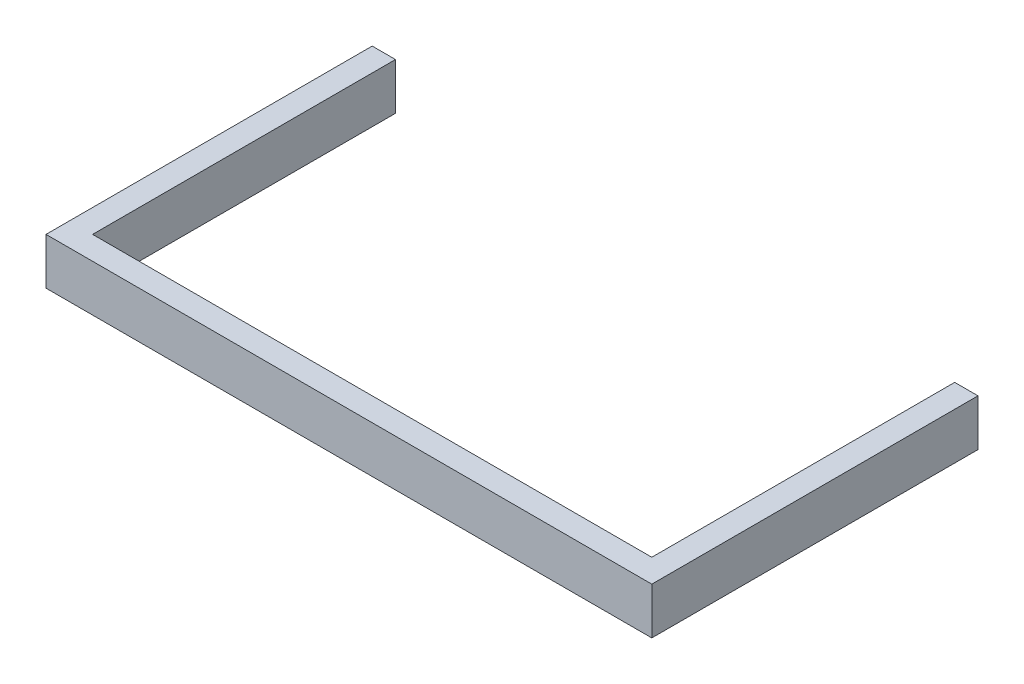
ISO-10303-21;
HEADER;
FILE_DESCRIPTION(('STEP AP214'),'2;1');
FILE_NAME('part.step','',(''),(''),'','','');
FILE_SCHEMA(('AUTOMOTIVE_DESIGN { 1 0 10303 214 1 1 1 1 }'));
ENDSEC;
DATA;
#1=APPLICATION_CONTEXT('core data for automotive mechanical design processes');
#2=APPLICATION_PROTOCOL_DEFINITION('international standard','automotive_design',2000,#1);
#3=PRODUCT_CONTEXT('',#1,'mechanical');
#4=PRODUCT('Part','Part','',(#3));
#5=PRODUCT_RELATED_PRODUCT_CATEGORY('part','',(#4));
#6=PRODUCT_DEFINITION_FORMATION('','',#4);
#7=PRODUCT_DEFINITION_CONTEXT('part definition',#1,'design');
#8=PRODUCT_DEFINITION('design','',#6,#7);
#9=PRODUCT_DEFINITION_SHAPE('','',#8);
#10=(LENGTH_UNIT() NAMED_UNIT(*) SI_UNIT(.MILLI.,.METRE.));
#11=(NAMED_UNIT(*) PLANE_ANGLE_UNIT() SI_UNIT($,.RADIAN.));
#12=(NAMED_UNIT(*) SI_UNIT($,.STERADIAN.) SOLID_ANGLE_UNIT());
#13=UNCERTAINTY_MEASURE_WITH_UNIT(LENGTH_MEASURE(1.E-05),#10,'distance_accuracy_value','');
#14=(GEOMETRIC_REPRESENTATION_CONTEXT(3) GLOBAL_UNCERTAINTY_ASSIGNED_CONTEXT((#13)) GLOBAL_UNIT_ASSIGNED_CONTEXT((#10,
#11,#12)) REPRESENTATION_CONTEXT('',''));
#15=CARTESIAN_POINT('',(0.,0.,0.));
#16=DIRECTION('',(0.,0.,1.));
#17=DIRECTION('',(1.,0.,0.));
#18=AXIS2_PLACEMENT_3D('',#15,#16,#17);
#19=CARTESIAN_POINT('',(0.,50.8000000000004,-25.4000000000003));
#20=DIRECTION('',(0.,0.,-1.));
#21=DIRECTION('',(-1.,0.,0.));
#22=AXIS2_PLACEMENT_3D('',#19,#20,#21);
#23=PLANE('',#22);
#24=DIRECTION('',(1.,0.,0.));
#25=VECTOR('',#24,1.);
#26=CARTESIAN_POINT('',(0.,-2.22044604925031E-13,-25.4000000000003));
#27=LINE('',#26,#25);
#28=CARTESIAN_POINT('',(25.4000000000001,0.,-25.3999999999999));
#29=VERTEX_POINT('',#28);
#30=CARTESIAN_POINT('',(635.,-1.33226762955019E-12,-25.3999999999994));
#31=VERTEX_POINT('',#30);
#32=EDGE_CURVE('E131',#29,#31,#27,.T.);
#33=ORIENTED_EDGE('',*,*,#32,.F.);
#34=DIRECTION('',(0.,-1.,0.));
#35=VECTOR('',#34,1.);
#36=CARTESIAN_POINT('',(25.4000000000001,50.8,-25.3999999999999));
#37=LINE('',#36,#35);
#38=CARTESIAN_POINT('',(25.4000000000001,50.8,-25.3999999999999));
#39=VERTEX_POINT('',#38);
#40=EDGE_CURVE('E11',#39,#29,#37,.T.);
#41=ORIENTED_EDGE('',*,*,#40,.F.);
#42=DIRECTION('',(1.,0.,0.));
#43=VECTOR('',#42,1.);
#44=CARTESIAN_POINT('',(0.,50.8000000000004,-25.4000000000003));
#45=LINE('',#44,#43);
#46=CARTESIAN_POINT('',(635.,50.8000000000017,-25.3999999999994));
#47=VERTEX_POINT('',#46);
#48=EDGE_CURVE('E150',#39,#47,#45,.T.);
#49=ORIENTED_EDGE('',*,*,#48,.T.);
#50=DIRECTION('',(0.,-1.,0.));
#51=VECTOR('',#50,1.);
#52=CARTESIAN_POINT('',(635.,50.8000000000017,-25.3999999999994));
#53=LINE('',#52,#51);
#54=EDGE_CURVE('E52',#47,#31,#53,.T.);
#55=ORIENTED_EDGE('',*,*,#54,.T.);
#56=EDGE_LOOP('',(#33,#41,#49,#55));
#57=FACE_BOUND('',#56,.T.);
#58=ADVANCED_FACE('F36',(#57),#23,.T.);
#59=CARTESIAN_POINT('',(25.4000000000001,50.7999999999995,1.11022302462516E-12));
#60=DIRECTION('',(-1.,0.,0.));
#61=DIRECTION('',(0.,0.,1.));
#62=AXIS2_PLACEMENT_3D('',#59,#60,#61);
#63=PLANE('',#62);
#64=DIRECTION('',(0.,0.,-1.));
#65=VECTOR('',#64,1.);
#66=CARTESIAN_POINT('',(25.4000000000001,0.,0.));
#67=LINE('',#66,#65);
#68=CARTESIAN_POINT('',(25.3999999999988,0.,-355.6));
#69=VERTEX_POINT('',#68);
#70=EDGE_CURVE('E133',#29,#69,#67,.T.);
#71=ORIENTED_EDGE('',*,*,#70,.T.);
#72=DIRECTION('',(0.,-1.,0.));
#73=VECTOR('',#72,1.);
#74=CARTESIAN_POINT('',(25.4000000000001,50.8,-355.6));
#75=LINE('',#74,#73);
#76=CARTESIAN_POINT('',(25.4000000000001,50.8,-355.6));
#77=VERTEX_POINT('',#76);
#78=EDGE_CURVE('E44',#77,#69,#75,.T.);
#79=ORIENTED_EDGE('',*,*,#78,.F.);
#80=DIRECTION('',(0.,0.,-1.));
#81=VECTOR('',#80,1.);
#82=CARTESIAN_POINT('',(25.4000000000001,50.7999999999995,1.11022302462516E-12));
#83=LINE('',#82,#81);
#84=EDGE_CURVE('E175',#39,#77,#83,.T.);
#85=ORIENTED_EDGE('',*,*,#84,.F.);
#86=ORIENTED_EDGE('',*,*,#40,.T.);
#87=EDGE_LOOP('',(#71,#79,#85,#86));
#88=FACE_BOUND('',#87,.T.);
#89=ADVANCED_FACE('F166',(#88),#63,.F.);
#90=CARTESIAN_POINT('',(-6.66133814775094E-13,50.8,-355.6));
#91=DIRECTION('',(0.,0.,-1.));
#92=DIRECTION('',(-1.,0.,0.));
#93=AXIS2_PLACEMENT_3D('',#90,#91,#92);
#94=PLANE('',#93);
#95=DIRECTION('',(1.,0.,0.));
#96=VECTOR('',#95,1.);
#97=CARTESIAN_POINT('',(-1.99840144432528E-12,0.,-355.6));
#98=LINE('',#97,#96);
#99=CARTESIAN_POINT('',(-1.33226762955019E-12,0.,-355.6));
#100=VERTEX_POINT('',#99);
#101=EDGE_CURVE('E136',#100,#69,#98,.T.);
#102=ORIENTED_EDGE('',*,*,#101,.F.);
#103=DIRECTION('',(0.,-1.,0.));
#104=VECTOR('',#103,1.);
#105=CARTESIAN_POINT('',(0.,50.8,-355.6));
#106=LINE('',#105,#104);
#107=CARTESIAN_POINT('',(0.,50.8,-355.6));
#108=VERTEX_POINT('',#107);
#109=EDGE_CURVE('E156',#108,#100,#106,.T.);
#110=ORIENTED_EDGE('',*,*,#109,.F.);
#111=DIRECTION('',(1.,0.,0.));
#112=VECTOR('',#111,1.);
#113=CARTESIAN_POINT('',(-6.66133814775094E-13,50.8,-355.6));
#114=LINE('',#113,#112);
#115=EDGE_CURVE('E163',#108,#77,#114,.T.);
#116=ORIENTED_EDGE('',*,*,#115,.T.);
#117=ORIENTED_EDGE('',*,*,#78,.T.);
#118=EDGE_LOOP('',(#102,#110,#116,#117));
#119=FACE_BOUND('',#118,.T.);
#120=ADVANCED_FACE('F161',(#119),#94,.T.);
#121=CARTESIAN_POINT('',(0.,50.7999999999991,2.22044604925031E-13));
#122=DIRECTION('',(-1.,0.,0.));
#123=DIRECTION('',(0.,0.,1.));
#124=AXIS2_PLACEMENT_3D('',#121,#122,#123);
#125=PLANE('',#124);
#126=DIRECTION('',(0.,0.,-1.));
#127=VECTOR('',#126,1.);
#128=CARTESIAN_POINT('',(0.,0.,0.));
#129=LINE('',#128,#127);
#130=CARTESIAN_POINT('',(0.,0.,0.));
#131=VERTEX_POINT('',#130);
#132=EDGE_CURVE('E139',#131,#100,#129,.T.);
#133=ORIENTED_EDGE('',*,*,#132,.F.);
#134=DIRECTION('',(0.,-1.,0.));
#135=VECTOR('',#134,1.);
#136=CARTESIAN_POINT('',(0.,50.7999999999991,2.22044604925031E-13));
#137=LINE('',#136,#135);
#138=CARTESIAN_POINT('',(0.,50.7999999999991,2.22044604925031E-13));
#139=VERTEX_POINT('',#138);
#140=EDGE_CURVE('E154',#139,#131,#137,.T.);
#141=ORIENTED_EDGE('',*,*,#140,.F.);
#142=DIRECTION('',(0.,0.,-1.));
#143=VECTOR('',#142,1.);
#144=CARTESIAN_POINT('',(0.,50.7999999999991,2.22044604925031E-13));
#145=LINE('',#144,#143);
#146=EDGE_CURVE('E174',#139,#108,#145,.T.);
#147=ORIENTED_EDGE('',*,*,#146,.T.);
#148=ORIENTED_EDGE('',*,*,#109,.T.);
#149=EDGE_LOOP('',(#133,#141,#147,#148));
#150=FACE_BOUND('',#149,.T.);
#151=ADVANCED_FACE('F172',(#150),#125,.T.);
#152=CARTESIAN_POINT('',(0.,50.7999999999991,2.22044604925031E-13));
#153=DIRECTION('',(0.,0.,-1.));
#154=DIRECTION('',(-1.,0.,0.));
#155=AXIS2_PLACEMENT_3D('',#152,#153,#154);
#156=PLANE('',#155);
#157=DIRECTION('',(1.,0.,0.));
#158=VECTOR('',#157,1.);
#159=CARTESIAN_POINT('',(0.,0.,0.));
#160=LINE('',#159,#158);
#161=CARTESIAN_POINT('',(660.4,0.,0.));
#162=VERTEX_POINT('',#161);
#163=EDGE_CURVE('E142',#131,#162,#160,.T.);
#164=ORIENTED_EDGE('',*,*,#163,.T.);
#165=DIRECTION('',(0.,-1.,0.));
#166=VECTOR('',#165,1.);
#167=CARTESIAN_POINT('',(660.4,50.8,1.11022302462516E-12));
#168=LINE('',#167,#166);
#169=CARTESIAN_POINT('',(660.4,50.8,1.11022302462516E-12));
#170=VERTEX_POINT('',#169);
#171=EDGE_CURVE('E123',#170,#162,#168,.T.);
#172=ORIENTED_EDGE('',*,*,#171,.F.);
#173=DIRECTION('',(1.,0.,0.));
#174=VECTOR('',#173,1.);
#175=CARTESIAN_POINT('',(0.,50.7999999999991,2.22044604925031E-13));
#176=LINE('',#175,#174);
#177=EDGE_CURVE('E111',#139,#170,#176,.T.);
#178=ORIENTED_EDGE('',*,*,#177,.F.);
#179=ORIENTED_EDGE('',*,*,#140,.T.);
#180=EDGE_LOOP('',(#164,#172,#178,#179));
#181=FACE_BOUND('',#180,.T.);
#182=ADVANCED_FACE('F201',(#181),#156,.F.);
#183=CARTESIAN_POINT('',(660.4,50.8,1.11022302462516E-12));
#184=DIRECTION('',(-1.,0.,0.));
#185=DIRECTION('',(0.,0.,1.));
#186=AXIS2_PLACEMENT_3D('',#183,#184,#185);
#187=PLANE('',#186);
#188=DIRECTION('',(0.,0.,-1.));
#189=VECTOR('',#188,1.);
#190=CARTESIAN_POINT('',(660.4,0.,0.));
#191=LINE('',#190,#189);
#192=CARTESIAN_POINT('',(660.399999999999,-8.88178419700125E-13,-355.6));
#193=VERTEX_POINT('',#192);
#194=EDGE_CURVE('E120',#162,#193,#191,.T.);
#195=ORIENTED_EDGE('',*,*,#194,.T.);
#196=DIRECTION('',(0.,-1.,0.));
#197=VECTOR('',#196,1.);
#198=CARTESIAN_POINT('',(660.4,50.8000000000004,-355.6));
#199=LINE('',#198,#197);
#200=CARTESIAN_POINT('',(660.4,50.8000000000004,-355.6));
#201=VERTEX_POINT('',#200);
#202=EDGE_CURVE('E117',#201,#193,#199,.T.);
#203=ORIENTED_EDGE('',*,*,#202,.F.);
#204=DIRECTION('',(0.,0.,-1.));
#205=VECTOR('',#204,1.);
#206=CARTESIAN_POINT('',(660.4,50.8,1.11022302462516E-12));
#207=LINE('',#206,#205);
#208=EDGE_CURVE('E102',#170,#201,#207,.T.);
#209=ORIENTED_EDGE('',*,*,#208,.F.);
#210=ORIENTED_EDGE('',*,*,#171,.T.);
#211=EDGE_LOOP('',(#195,#203,#209,#210));
#212=FACE_BOUND('',#211,.T.);
#213=ADVANCED_FACE('F118',(#212),#187,.F.);
#214=CARTESIAN_POINT('',(0.,50.8,-355.6));
#215=DIRECTION('',(0.,0.,1.));
#216=DIRECTION('',(1.,0.,0.));
#217=AXIS2_PLACEMENT_3D('',#214,#215,#216);
#218=PLANE('',#217);
#219=DIRECTION('',(-1.,0.,0.));
#220=VECTOR('',#219,1.);
#221=CARTESIAN_POINT('',(-1.33226762955019E-12,0.,-355.6));
#222=LINE('',#221,#220);
#223=CARTESIAN_POINT('',(634.999999999999,-8.88178419700125E-13,-355.6));
#224=VERTEX_POINT('',#223);
#225=EDGE_CURVE('E145',#193,#224,#222,.T.);
#226=ORIENTED_EDGE('',*,*,#225,.T.);
#227=DIRECTION('',(0.,-1.,0.));
#228=VECTOR('',#227,1.);
#229=CARTESIAN_POINT('',(635.,50.8000000000004,-355.6));
#230=LINE('',#229,#228);
#231=CARTESIAN_POINT('',(635.,50.8000000000004,-355.6));
#232=VERTEX_POINT('',#231);
#233=EDGE_CURVE('E78',#232,#224,#230,.T.);
#234=ORIENTED_EDGE('',*,*,#233,.F.);
#235=DIRECTION('',(-1.,0.,0.));
#236=VECTOR('',#235,1.);
#237=CARTESIAN_POINT('',(0.,50.8,-355.6));
#238=LINE('',#237,#236);
#239=EDGE_CURVE('E108',#201,#232,#238,.T.);
#240=ORIENTED_EDGE('',*,*,#239,.F.);
#241=ORIENTED_EDGE('',*,*,#202,.T.);
#242=EDGE_LOOP('',(#226,#234,#240,#241));
#243=FACE_BOUND('',#242,.T.);
#244=ADVANCED_FACE('F125',(#243),#218,.F.);
#245=CARTESIAN_POINT('',(635.000000000004,50.8000000000004,-7.99360577730113E-12));
#246=DIRECTION('',(-1.,0.,0.));
#247=DIRECTION('',(0.,0.,1.));
#248=AXIS2_PLACEMENT_3D('',#245,#246,#247);
#249=PLANE('',#248);
#250=DIRECTION('',(0.,0.,-1.));
#251=VECTOR('',#250,1.);
#252=CARTESIAN_POINT('',(635.000000000004,-2.22044604925031E-13,-7.54951656745106E-12));
#253=LINE('',#252,#251);
#254=EDGE_CURVE('E147',#31,#224,#253,.T.);
#255=ORIENTED_EDGE('',*,*,#254,.F.);
#256=ORIENTED_EDGE('',*,*,#54,.F.);
#257=DIRECTION('',(0.,0.,-1.));
#258=VECTOR('',#257,1.);
#259=CARTESIAN_POINT('',(635.000000000004,50.8000000000004,-7.99360577730113E-12));
#260=LINE('',#259,#258);
#261=EDGE_CURVE('E126',#47,#232,#260,.T.);
#262=ORIENTED_EDGE('',*,*,#261,.T.);
#263=ORIENTED_EDGE('',*,*,#233,.T.);
#264=EDGE_LOOP('',(#255,#256,#262,#263));
#265=FACE_BOUND('',#264,.T.);
#266=ADVANCED_FACE('F180',(#265),#249,.T.);
#267=CARTESIAN_POINT('',(0.,50.7999999999991,2.22044604925031E-13));
#268=DIRECTION('',(0.,1.,0.));
#269=DIRECTION('',(0.,0.,1.));
#270=AXIS2_PLACEMENT_3D('',#267,#268,#269);
#271=PLANE('',#270);
#272=ORIENTED_EDGE('',*,*,#48,.F.);
#273=ORIENTED_EDGE('',*,*,#84,.T.);
#274=ORIENTED_EDGE('',*,*,#115,.F.);
#275=ORIENTED_EDGE('',*,*,#146,.F.);
#276=ORIENTED_EDGE('',*,*,#177,.T.);
#277=ORIENTED_EDGE('',*,*,#208,.T.);
#278=ORIENTED_EDGE('',*,*,#239,.T.);
#279=ORIENTED_EDGE('',*,*,#261,.F.);
#280=EDGE_LOOP('',(#272,#273,#274,#275,#276,#277,#278,#279));
#281=FACE_BOUND('',#280,.T.);
#282=ADVANCED_FACE('F105',(#281),#271,.T.);
#283=CARTESIAN_POINT('',(0.,0.,0.));
#284=DIRECTION('',(0.,1.,0.));
#285=DIRECTION('',(0.,0.,1.));
#286=AXIS2_PLACEMENT_3D('',#283,#284,#285);
#287=PLANE('',#286);
#288=ORIENTED_EDGE('',*,*,#32,.T.);
#289=ORIENTED_EDGE('',*,*,#254,.T.);
#290=ORIENTED_EDGE('',*,*,#225,.F.);
#291=ORIENTED_EDGE('',*,*,#194,.F.);
#292=ORIENTED_EDGE('',*,*,#163,.F.);
#293=ORIENTED_EDGE('',*,*,#132,.T.);
#294=ORIENTED_EDGE('',*,*,#101,.T.);
#295=ORIENTED_EDGE('',*,*,#70,.F.);
#296=EDGE_LOOP('',(#288,#289,#290,#291,#292,#293,#294,#295));
#297=FACE_BOUND('',#296,.T.);
#298=ADVANCED_FACE('F168',(#297),#287,.F.);
#299=CLOSED_SHELL('',(#58,#89,#120,#151,#182,#213,#244,#266,#282,#298));
#300=MANIFOLD_SOLID_BREP('B2',#299);
#301=ADVANCED_BREP_SHAPE_REPRESENTATION('',(#18,#300),#14);
#302=SHAPE_DEFINITION_REPRESENTATION(#9,#301);
ENDSEC;
END-ISO-10303-21;
